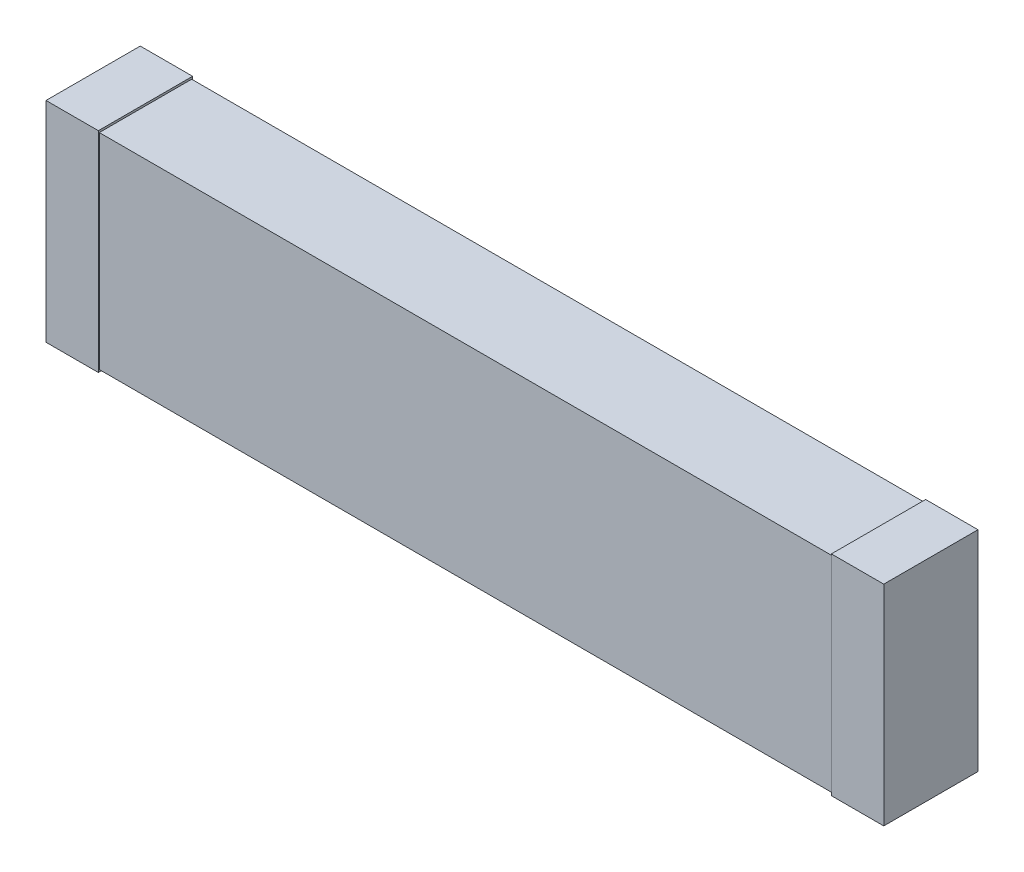
ISO-10303-21;
HEADER;
FILE_DESCRIPTION(('STEP AP214'),'2;1');
FILE_NAME('part.step','',(''),(''),'','','');
FILE_SCHEMA(('AUTOMOTIVE_DESIGN { 1 0 10303 214 1 1 1 1 }'));
ENDSEC;
DATA;
#1=APPLICATION_CONTEXT('core data for automotive mechanical design processes');
#2=APPLICATION_PROTOCOL_DEFINITION('international standard','automotive_design',2000,#1);
#3=PRODUCT_CONTEXT('',#1,'mechanical');
#4=PRODUCT('Part','Part','',(#3));
#5=PRODUCT_RELATED_PRODUCT_CATEGORY('part','',(#4));
#6=PRODUCT_DEFINITION_FORMATION('','',#4);
#7=PRODUCT_DEFINITION_CONTEXT('part definition',#1,'design');
#8=PRODUCT_DEFINITION('design','',#6,#7);
#9=PRODUCT_DEFINITION_SHAPE('','',#8);
#10=(LENGTH_UNIT() NAMED_UNIT(*) SI_UNIT(.MILLI.,.METRE.));
#11=(NAMED_UNIT(*) PLANE_ANGLE_UNIT() SI_UNIT($,.RADIAN.));
#12=(NAMED_UNIT(*) SI_UNIT($,.STERADIAN.) SOLID_ANGLE_UNIT());
#13=UNCERTAINTY_MEASURE_WITH_UNIT(LENGTH_MEASURE(1.E-05),#10,'distance_accuracy_value','');
#14=(GEOMETRIC_REPRESENTATION_CONTEXT(3) GLOBAL_UNCERTAINTY_ASSIGNED_CONTEXT((#13)) GLOBAL_UNIT_ASSIGNED_CONTEXT((#10,
#11,#12)) REPRESENTATION_CONTEXT('',''));
#15=CARTESIAN_POINT('',(0.,0.,0.));
#16=DIRECTION('',(0.,0.,1.));
#17=DIRECTION('',(1.,0.,0.));
#18=AXIS2_PLACEMENT_3D('',#15,#16,#17);
#19=CARTESIAN_POINT('',(-3.5,-0.98,0.891));
#20=DIRECTION('',(0.,0.,1.));
#21=DIRECTION('',(1.,0.,0.));
#22=AXIS2_PLACEMENT_3D('',#19,#20,#21);
#23=PLANE('',#22);
#24=DIRECTION('',(0.,1.,0.));
#25=VECTOR('',#24,1.);
#26=CARTESIAN_POINT('',(3.5,-0.98,0.891));
#27=LINE('',#26,#25);
#28=CARTESIAN_POINT('',(3.5,0.98,0.891));
#29=VERTEX_POINT('',#28);
#30=CARTESIAN_POINT('',(3.5,-0.98,0.891));
#31=VERTEX_POINT('',#30);
#32=EDGE_CURVE('P0_E76',#29,#31,#27,.F.);
#33=ORIENTED_EDGE('',*,*,#32,.F.);
#34=DIRECTION('',(1.,0.,0.));
#35=VECTOR('',#34,1.);
#36=CARTESIAN_POINT('',(-3.5,0.98,0.891));
#37=LINE('',#36,#35);
#38=CARTESIAN_POINT('',(-3.5,0.98,0.891));
#39=VERTEX_POINT('',#38);
#40=EDGE_CURVE('P0_E58',#39,#29,#37,.T.);
#41=ORIENTED_EDGE('',*,*,#40,.F.);
#42=DIRECTION('',(0.,1.,0.));
#43=VECTOR('',#42,1.);
#44=CARTESIAN_POINT('',(-3.5,-0.98,0.891));
#45=LINE('',#44,#43);
#46=CARTESIAN_POINT('',(-3.5,-0.98,0.891));
#47=VERTEX_POINT('',#46);
#48=EDGE_CURVE('P0_E20',#39,#47,#45,.F.);
#49=ORIENTED_EDGE('',*,*,#48,.T.);
#50=DIRECTION('',(1.,0.,0.));
#51=VECTOR('',#50,1.);
#52=CARTESIAN_POINT('',(-3.5,-0.98,0.891));
#53=LINE('',#52,#51);
#54=EDGE_CURVE('P0_E55',#47,#31,#53,.T.);
#55=ORIENTED_EDGE('',*,*,#54,.T.);
#56=EDGE_LOOP('',(#33,#41,#49,#55));
#57=FACE_BOUND('',#56,.T.);
#58=ADVANCED_FACE('P0_F17',(#57),#23,.T.);
#59=CARTESIAN_POINT('',(-3.5,-0.98,0.009));
#60=DIRECTION('',(1.,0.,0.));
#61=DIRECTION('',(0.,0.,-1.));
#62=AXIS2_PLACEMENT_3D('',#59,#60,#61);
#63=PLANE('',#62);
#64=DIRECTION('',(0.,0.,1.));
#65=VECTOR('',#64,1.);
#66=CARTESIAN_POINT('',(-3.5,0.98,0.009));
#67=LINE('',#66,#65);
#68=CARTESIAN_POINT('',(-3.5,0.98,0.009));
#69=VERTEX_POINT('',#68);
#70=EDGE_CURVE('P0_E78',#69,#39,#67,.T.);
#71=ORIENTED_EDGE('',*,*,#70,.F.);
#72=DIRECTION('',(0.,1.,0.));
#73=VECTOR('',#72,1.);
#74=CARTESIAN_POINT('',(-3.5,-0.98,0.009));
#75=LINE('',#74,#73);
#76=CARTESIAN_POINT('',(-3.5,-0.98,0.009));
#77=VERTEX_POINT('',#76);
#78=EDGE_CURVE('P0_E73',#69,#77,#75,.F.);
#79=ORIENTED_EDGE('',*,*,#78,.T.);
#80=DIRECTION('',(0.,0.,1.));
#81=VECTOR('',#80,1.);
#82=CARTESIAN_POINT('',(-3.5,-0.98,0.009));
#83=LINE('',#82,#81);
#84=EDGE_CURVE('P0_E63',#77,#47,#83,.T.);
#85=ORIENTED_EDGE('',*,*,#84,.T.);
#86=ORIENTED_EDGE('',*,*,#48,.F.);
#87=EDGE_LOOP('',(#71,#79,#85,#86));
#88=FACE_BOUND('',#87,.T.);
#89=ADVANCED_FACE('P0_F72',(#88),#63,.F.);
#90=CARTESIAN_POINT('',(-3.5,-0.98,0.009));
#91=DIRECTION('',(0.,1.,0.));
#92=DIRECTION('',(0.,0.,1.));
#93=AXIS2_PLACEMENT_3D('',#90,#91,#92);
#94=PLANE('',#93);
#95=ORIENTED_EDGE('',*,*,#54,.F.);
#96=ORIENTED_EDGE('',*,*,#84,.F.);
#97=DIRECTION('',(1.,0.,0.));
#98=VECTOR('',#97,1.);
#99=CARTESIAN_POINT('',(-3.5,-0.98,0.009));
#100=LINE('',#99,#98);
#101=CARTESIAN_POINT('',(3.5,-0.98,0.009));
#102=VERTEX_POINT('',#101);
#103=EDGE_CURVE('P0_E83',#77,#102,#100,.T.);
#104=ORIENTED_EDGE('',*,*,#103,.T.);
#105=DIRECTION('',(0.,0.,-1.));
#106=VECTOR('',#105,1.);
#107=CARTESIAN_POINT('',(3.5,-0.98,0.009));
#108=LINE('',#107,#106);
#109=EDGE_CURVE('P0_E69',#31,#102,#108,.T.);
#110=ORIENTED_EDGE('',*,*,#109,.F.);
#111=EDGE_LOOP('',(#95,#96,#104,#110));
#112=FACE_BOUND('',#111,.T.);
#113=ADVANCED_FACE('P0_F66',(#112),#94,.F.);
#114=CARTESIAN_POINT('',(3.5,-0.98,0.009));
#115=DIRECTION('',(1.,0.,0.));
#116=DIRECTION('',(0.,0.,-1.));
#117=AXIS2_PLACEMENT_3D('',#114,#115,#116);
#118=PLANE('',#117);
#119=DIRECTION('',(0.,0.,1.));
#120=VECTOR('',#119,1.);
#121=CARTESIAN_POINT('',(3.5,0.98,0.009));
#122=LINE('',#121,#120);
#123=CARTESIAN_POINT('',(3.5,0.98,0.009));
#124=VERTEX_POINT('',#123);
#125=EDGE_CURVE('P0_E34',#29,#124,#122,.F.);
#126=ORIENTED_EDGE('',*,*,#125,.F.);
#127=ORIENTED_EDGE('',*,*,#32,.T.);
#128=ORIENTED_EDGE('',*,*,#109,.T.);
#129=DIRECTION('',(0.,1.,0.));
#130=VECTOR('',#129,1.);
#131=CARTESIAN_POINT('',(3.5,-0.98,0.009));
#132=LINE('',#131,#130);
#133=EDGE_CURVE('P0_E26',#102,#124,#132,.T.);
#134=ORIENTED_EDGE('',*,*,#133,.T.);
#135=EDGE_LOOP('',(#126,#127,#128,#134));
#136=FACE_BOUND('',#135,.T.);
#137=ADVANCED_FACE('P0_F88',(#136),#118,.T.);
#138=CARTESIAN_POINT('',(-3.5,0.98,0.009));
#139=DIRECTION('',(0.,1.,0.));
#140=DIRECTION('',(0.,0.,1.));
#141=AXIS2_PLACEMENT_3D('',#138,#139,#140);
#142=PLANE('',#141);
#143=ORIENTED_EDGE('',*,*,#40,.T.);
#144=ORIENTED_EDGE('',*,*,#125,.T.);
#145=DIRECTION('',(1.,0.,0.));
#146=VECTOR('',#145,1.);
#147=CARTESIAN_POINT('',(-3.5,0.98,0.009));
#148=LINE('',#147,#146);
#149=EDGE_CURVE('P0_E11',#124,#69,#148,.F.);
#150=ORIENTED_EDGE('',*,*,#149,.T.);
#151=ORIENTED_EDGE('',*,*,#70,.T.);
#152=EDGE_LOOP('',(#143,#144,#150,#151));
#153=FACE_BOUND('',#152,.T.);
#154=ADVANCED_FACE('P0_F91',(#153),#142,.T.);
#155=CARTESIAN_POINT('',(-3.5,-0.98,0.009));
#156=DIRECTION('',(0.,0.,1.));
#157=DIRECTION('',(1.,0.,0.));
#158=AXIS2_PLACEMENT_3D('',#155,#156,#157);
#159=PLANE('',#158);
#160=ORIENTED_EDGE('',*,*,#133,.F.);
#161=ORIENTED_EDGE('',*,*,#103,.F.);
#162=ORIENTED_EDGE('',*,*,#78,.F.);
#163=ORIENTED_EDGE('',*,*,#149,.F.);
#164=EDGE_LOOP('',(#160,#161,#162,#163));
#165=FACE_BOUND('',#164,.T.);
#166=ADVANCED_FACE('P0_F90',(#165),#159,.F.);
#167=CLOSED_SHELL('',(#58,#89,#113,#137,#154,#166));
#168=MANIFOLD_SOLID_BREP('P0_B1',#167);
#169=CARTESIAN_POINT('',(-3.5,-1.,0.));
#170=DIRECTION('',(1.,0.,0.));
#171=DIRECTION('',(0.,0.,-1.));
#172=AXIS2_PLACEMENT_3D('',#169,#170,#171);
#173=PLANE('',#172);
#174=DIRECTION('',(0.,0.,1.));
#175=VECTOR('',#174,1.);
#176=CARTESIAN_POINT('',(-3.5,1.,0.));
#177=LINE('',#176,#175);
#178=CARTESIAN_POINT('',(-3.5,1.,0.9));
#179=VERTEX_POINT('',#178);
#180=CARTESIAN_POINT('',(-3.5,1.,0.));
#181=VERTEX_POINT('',#180);
#182=EDGE_CURVE('P1_E76',#179,#181,#177,.F.);
#183=ORIENTED_EDGE('',*,*,#182,.F.);
#184=DIRECTION('',(0.,1.,0.));
#185=VECTOR('',#184,1.);
#186=CARTESIAN_POINT('',(-3.5,-1.,0.9));
#187=LINE('',#186,#185);
#188=CARTESIAN_POINT('',(-3.5,-1.,0.9));
#189=VERTEX_POINT('',#188);
#190=EDGE_CURVE('P1_E58',#189,#179,#187,.T.);
#191=ORIENTED_EDGE('',*,*,#190,.F.);
#192=DIRECTION('',(0.,0.,1.));
#193=VECTOR('',#192,1.);
#194=CARTESIAN_POINT('',(-3.5,-1.,0.));
#195=LINE('',#194,#193);
#196=CARTESIAN_POINT('',(-3.5,-1.,0.));
#197=VERTEX_POINT('',#196);
#198=EDGE_CURVE('P1_E20',#189,#197,#195,.F.);
#199=ORIENTED_EDGE('',*,*,#198,.T.);
#200=DIRECTION('',(0.,1.,0.));
#201=VECTOR('',#200,1.);
#202=CARTESIAN_POINT('',(-3.5,-1.,0.));
#203=LINE('',#202,#201);
#204=EDGE_CURVE('P1_E55',#197,#181,#203,.T.);
#205=ORIENTED_EDGE('',*,*,#204,.T.);
#206=EDGE_LOOP('',(#183,#191,#199,#205));
#207=FACE_BOUND('',#206,.T.);
#208=ADVANCED_FACE('P1_F17',(#207),#173,.T.);
#209=CARTESIAN_POINT('',(-4.,-1.,0.));
#210=DIRECTION('',(0.,1.,0.));
#211=DIRECTION('',(0.,0.,1.));
#212=AXIS2_PLACEMENT_3D('',#209,#210,#211);
#213=PLANE('',#212);
#214=DIRECTION('',(1.,0.,0.));
#215=VECTOR('',#214,1.);
#216=CARTESIAN_POINT('',(-4.,-1.,0.9));
#217=LINE('',#216,#215);
#218=CARTESIAN_POINT('',(-4.,-1.,0.9));
#219=VERTEX_POINT('',#218);
#220=EDGE_CURVE('P1_E78',#219,#189,#217,.T.);
#221=ORIENTED_EDGE('',*,*,#220,.F.);
#222=DIRECTION('',(0.,0.,-1.));
#223=VECTOR('',#222,1.);
#224=CARTESIAN_POINT('',(-4.,-1.,0.));
#225=LINE('',#224,#223);
#226=CARTESIAN_POINT('',(-4.,-1.,0.));
#227=VERTEX_POINT('',#226);
#228=EDGE_CURVE('P1_E73',#219,#227,#225,.T.);
#229=ORIENTED_EDGE('',*,*,#228,.T.);
#230=DIRECTION('',(1.,0.,0.));
#231=VECTOR('',#230,1.);
#232=CARTESIAN_POINT('',(-4.,-1.,0.));
#233=LINE('',#232,#231);
#234=EDGE_CURVE('P1_E63',#227,#197,#233,.T.);
#235=ORIENTED_EDGE('',*,*,#234,.T.);
#236=ORIENTED_EDGE('',*,*,#198,.F.);
#237=EDGE_LOOP('',(#221,#229,#235,#236));
#238=FACE_BOUND('',#237,.T.);
#239=ADVANCED_FACE('P1_F72',(#238),#213,.F.);
#240=CARTESIAN_POINT('',(-4.,-1.,0.));
#241=DIRECTION('',(0.,0.,1.));
#242=DIRECTION('',(1.,0.,0.));
#243=AXIS2_PLACEMENT_3D('',#240,#241,#242);
#244=PLANE('',#243);
#245=ORIENTED_EDGE('',*,*,#204,.F.);
#246=ORIENTED_EDGE('',*,*,#234,.F.);
#247=DIRECTION('',(0.,1.,0.));
#248=VECTOR('',#247,1.);
#249=CARTESIAN_POINT('',(-4.,-1.,0.));
#250=LINE('',#249,#248);
#251=CARTESIAN_POINT('',(-4.,1.,0.));
#252=VERTEX_POINT('',#251);
#253=EDGE_CURVE('P1_E83',#227,#252,#250,.T.);
#254=ORIENTED_EDGE('',*,*,#253,.T.);
#255=DIRECTION('',(1.,0.,0.));
#256=VECTOR('',#255,1.);
#257=CARTESIAN_POINT('',(-4.,1.,0.));
#258=LINE('',#257,#256);
#259=EDGE_CURVE('P1_E69',#181,#252,#258,.F.);
#260=ORIENTED_EDGE('',*,*,#259,.F.);
#261=EDGE_LOOP('',(#245,#246,#254,#260));
#262=FACE_BOUND('',#261,.T.);
#263=ADVANCED_FACE('P1_F66',(#262),#244,.F.);
#264=CARTESIAN_POINT('',(-4.,1.,0.));
#265=DIRECTION('',(0.,1.,0.));
#266=DIRECTION('',(0.,0.,1.));
#267=AXIS2_PLACEMENT_3D('',#264,#265,#266);
#268=PLANE('',#267);
#269=DIRECTION('',(1.,0.,0.));
#270=VECTOR('',#269,1.);
#271=CARTESIAN_POINT('',(-4.,1.,0.9));
#272=LINE('',#271,#270);
#273=CARTESIAN_POINT('',(-4.,1.,0.9));
#274=VERTEX_POINT('',#273);
#275=EDGE_CURVE('P1_E34',#179,#274,#272,.F.);
#276=ORIENTED_EDGE('',*,*,#275,.F.);
#277=ORIENTED_EDGE('',*,*,#182,.T.);
#278=ORIENTED_EDGE('',*,*,#259,.T.);
#279=DIRECTION('',(0.,0.,-1.));
#280=VECTOR('',#279,1.);
#281=CARTESIAN_POINT('',(-4.,1.,0.));
#282=LINE('',#281,#280);
#283=EDGE_CURVE('P1_E26',#252,#274,#282,.F.);
#284=ORIENTED_EDGE('',*,*,#283,.T.);
#285=EDGE_LOOP('',(#276,#277,#278,#284));
#286=FACE_BOUND('',#285,.T.);
#287=ADVANCED_FACE('P1_F88',(#286),#268,.T.);
#288=CARTESIAN_POINT('',(-4.,-1.,0.9));
#289=DIRECTION('',(0.,0.,1.));
#290=DIRECTION('',(1.,0.,0.));
#291=AXIS2_PLACEMENT_3D('',#288,#289,#290);
#292=PLANE('',#291);
#293=ORIENTED_EDGE('',*,*,#190,.T.);
#294=ORIENTED_EDGE('',*,*,#275,.T.);
#295=DIRECTION('',(0.,1.,0.));
#296=VECTOR('',#295,1.);
#297=CARTESIAN_POINT('',(-4.,-1.,0.9));
#298=LINE('',#297,#296);
#299=EDGE_CURVE('P1_E11',#274,#219,#298,.F.);
#300=ORIENTED_EDGE('',*,*,#299,.T.);
#301=ORIENTED_EDGE('',*,*,#220,.T.);
#302=EDGE_LOOP('',(#293,#294,#300,#301));
#303=FACE_BOUND('',#302,.T.);
#304=ADVANCED_FACE('P1_F91',(#303),#292,.T.);
#305=CARTESIAN_POINT('',(-4.,-1.,0.));
#306=DIRECTION('',(1.,0.,0.));
#307=DIRECTION('',(0.,0.,-1.));
#308=AXIS2_PLACEMENT_3D('',#305,#306,#307);
#309=PLANE('',#308);
#310=ORIENTED_EDGE('',*,*,#283,.F.);
#311=ORIENTED_EDGE('',*,*,#253,.F.);
#312=ORIENTED_EDGE('',*,*,#228,.F.);
#313=ORIENTED_EDGE('',*,*,#299,.F.);
#314=EDGE_LOOP('',(#310,#311,#312,#313));
#315=FACE_BOUND('',#314,.T.);
#316=ADVANCED_FACE('P1_F90',(#315),#309,.F.);
#317=CLOSED_SHELL('',(#208,#239,#263,#287,#304,#316));
#318=MANIFOLD_SOLID_BREP('P1_B1',#317);
#319=CARTESIAN_POINT('',(4.,-1.,0.));
#320=DIRECTION('',(1.,0.,0.));
#321=DIRECTION('',(0.,0.,-1.));
#322=AXIS2_PLACEMENT_3D('',#319,#320,#321);
#323=PLANE('',#322);
#324=DIRECTION('',(0.,0.,1.));
#325=VECTOR('',#324,1.);
#326=CARTESIAN_POINT('',(4.,1.,0.));
#327=LINE('',#326,#325);
#328=CARTESIAN_POINT('',(4.,1.,0.9));
#329=VERTEX_POINT('',#328);
#330=CARTESIAN_POINT('',(4.,1.,0.));
#331=VERTEX_POINT('',#330);
#332=EDGE_CURVE('P2_E76',#329,#331,#327,.F.);
#333=ORIENTED_EDGE('',*,*,#332,.F.);
#334=DIRECTION('',(0.,1.,0.));
#335=VECTOR('',#334,1.);
#336=CARTESIAN_POINT('',(4.,-1.,0.9));
#337=LINE('',#336,#335);
#338=CARTESIAN_POINT('',(4.,-1.,0.9));
#339=VERTEX_POINT('',#338);
#340=EDGE_CURVE('P2_E58',#339,#329,#337,.T.);
#341=ORIENTED_EDGE('',*,*,#340,.F.);
#342=DIRECTION('',(0.,0.,1.));
#343=VECTOR('',#342,1.);
#344=CARTESIAN_POINT('',(4.,-1.,0.));
#345=LINE('',#344,#343);
#346=CARTESIAN_POINT('',(4.,-1.,0.));
#347=VERTEX_POINT('',#346);
#348=EDGE_CURVE('P2_E20',#339,#347,#345,.F.);
#349=ORIENTED_EDGE('',*,*,#348,.T.);
#350=DIRECTION('',(0.,1.,0.));
#351=VECTOR('',#350,1.);
#352=CARTESIAN_POINT('',(4.,-1.,0.));
#353=LINE('',#352,#351);
#354=EDGE_CURVE('P2_E55',#347,#331,#353,.T.);
#355=ORIENTED_EDGE('',*,*,#354,.T.);
#356=EDGE_LOOP('',(#333,#341,#349,#355));
#357=FACE_BOUND('',#356,.T.);
#358=ADVANCED_FACE('P2_F17',(#357),#323,.T.);
#359=CARTESIAN_POINT('',(3.5,-1.,0.));
#360=DIRECTION('',(0.,1.,0.));
#361=DIRECTION('',(0.,0.,1.));
#362=AXIS2_PLACEMENT_3D('',#359,#360,#361);
#363=PLANE('',#362);
#364=DIRECTION('',(1.,0.,0.));
#365=VECTOR('',#364,1.);
#366=CARTESIAN_POINT('',(3.5,-1.,0.9));
#367=LINE('',#366,#365);
#368=CARTESIAN_POINT('',(3.5,-1.,0.9));
#369=VERTEX_POINT('',#368);
#370=EDGE_CURVE('P2_E78',#369,#339,#367,.T.);
#371=ORIENTED_EDGE('',*,*,#370,.F.);
#372=DIRECTION('',(0.,0.,-1.));
#373=VECTOR('',#372,1.);
#374=CARTESIAN_POINT('',(3.5,-1.,0.));
#375=LINE('',#374,#373);
#376=CARTESIAN_POINT('',(3.5,-1.,0.));
#377=VERTEX_POINT('',#376);
#378=EDGE_CURVE('P2_E73',#369,#377,#375,.T.);
#379=ORIENTED_EDGE('',*,*,#378,.T.);
#380=DIRECTION('',(1.,0.,0.));
#381=VECTOR('',#380,1.);
#382=CARTESIAN_POINT('',(3.5,-1.,0.));
#383=LINE('',#382,#381);
#384=EDGE_CURVE('P2_E63',#377,#347,#383,.T.);
#385=ORIENTED_EDGE('',*,*,#384,.T.);
#386=ORIENTED_EDGE('',*,*,#348,.F.);
#387=EDGE_LOOP('',(#371,#379,#385,#386));
#388=FACE_BOUND('',#387,.T.);
#389=ADVANCED_FACE('P2_F72',(#388),#363,.F.);
#390=CARTESIAN_POINT('',(3.5,-1.,0.));
#391=DIRECTION('',(0.,0.,1.));
#392=DIRECTION('',(1.,0.,0.));
#393=AXIS2_PLACEMENT_3D('',#390,#391,#392);
#394=PLANE('',#393);
#395=ORIENTED_EDGE('',*,*,#354,.F.);
#396=ORIENTED_EDGE('',*,*,#384,.F.);
#397=DIRECTION('',(0.,1.,0.));
#398=VECTOR('',#397,1.);
#399=CARTESIAN_POINT('',(3.5,-1.,0.));
#400=LINE('',#399,#398);
#401=CARTESIAN_POINT('',(3.5,1.,0.));
#402=VERTEX_POINT('',#401);
#403=EDGE_CURVE('P2_E83',#377,#402,#400,.T.);
#404=ORIENTED_EDGE('',*,*,#403,.T.);
#405=DIRECTION('',(1.,0.,0.));
#406=VECTOR('',#405,1.);
#407=CARTESIAN_POINT('',(3.5,1.,0.));
#408=LINE('',#407,#406);
#409=EDGE_CURVE('P2_E69',#331,#402,#408,.F.);
#410=ORIENTED_EDGE('',*,*,#409,.F.);
#411=EDGE_LOOP('',(#395,#396,#404,#410));
#412=FACE_BOUND('',#411,.T.);
#413=ADVANCED_FACE('P2_F66',(#412),#394,.F.);
#414=CARTESIAN_POINT('',(3.5,1.,0.));
#415=DIRECTION('',(0.,1.,0.));
#416=DIRECTION('',(0.,0.,1.));
#417=AXIS2_PLACEMENT_3D('',#414,#415,#416);
#418=PLANE('',#417);
#419=DIRECTION('',(1.,0.,0.));
#420=VECTOR('',#419,1.);
#421=CARTESIAN_POINT('',(3.5,1.,0.9));
#422=LINE('',#421,#420);
#423=CARTESIAN_POINT('',(3.5,1.,0.9));
#424=VERTEX_POINT('',#423);
#425=EDGE_CURVE('P2_E34',#329,#424,#422,.F.);
#426=ORIENTED_EDGE('',*,*,#425,.F.);
#427=ORIENTED_EDGE('',*,*,#332,.T.);
#428=ORIENTED_EDGE('',*,*,#409,.T.);
#429=DIRECTION('',(0.,0.,-1.));
#430=VECTOR('',#429,1.);
#431=CARTESIAN_POINT('',(3.5,1.,0.));
#432=LINE('',#431,#430);
#433=EDGE_CURVE('P2_E26',#402,#424,#432,.F.);
#434=ORIENTED_EDGE('',*,*,#433,.T.);
#435=EDGE_LOOP('',(#426,#427,#428,#434));
#436=FACE_BOUND('',#435,.T.);
#437=ADVANCED_FACE('P2_F88',(#436),#418,.T.);
#438=CARTESIAN_POINT('',(3.5,-1.,0.9));
#439=DIRECTION('',(0.,0.,1.));
#440=DIRECTION('',(1.,0.,0.));
#441=AXIS2_PLACEMENT_3D('',#438,#439,#440);
#442=PLANE('',#441);
#443=ORIENTED_EDGE('',*,*,#340,.T.);
#444=ORIENTED_EDGE('',*,*,#425,.T.);
#445=DIRECTION('',(0.,1.,0.));
#446=VECTOR('',#445,1.);
#447=CARTESIAN_POINT('',(3.5,-1.,0.9));
#448=LINE('',#447,#446);
#449=EDGE_CURVE('P2_E11',#424,#369,#448,.F.);
#450=ORIENTED_EDGE('',*,*,#449,.T.);
#451=ORIENTED_EDGE('',*,*,#370,.T.);
#452=EDGE_LOOP('',(#443,#444,#450,#451));
#453=FACE_BOUND('',#452,.T.);
#454=ADVANCED_FACE('P2_F91',(#453),#442,.T.);
#455=CARTESIAN_POINT('',(3.5,-1.,0.));
#456=DIRECTION('',(1.,0.,0.));
#457=DIRECTION('',(0.,0.,-1.));
#458=AXIS2_PLACEMENT_3D('',#455,#456,#457);
#459=PLANE('',#458);
#460=ORIENTED_EDGE('',*,*,#433,.F.);
#461=ORIENTED_EDGE('',*,*,#403,.F.);
#462=ORIENTED_EDGE('',*,*,#378,.F.);
#463=ORIENTED_EDGE('',*,*,#449,.F.);
#464=EDGE_LOOP('',(#460,#461,#462,#463));
#465=FACE_BOUND('',#464,.T.);
#466=ADVANCED_FACE('P2_F90',(#465),#459,.F.);
#467=CLOSED_SHELL('',(#358,#389,#413,#437,#454,#466));
#468=MANIFOLD_SOLID_BREP('P2_B1',#467);
#469=ADVANCED_BREP_SHAPE_REPRESENTATION('',(#18,#168,#318,#468),#14);
#470=SHAPE_DEFINITION_REPRESENTATION(#9,#469);
ENDSEC;
END-ISO-10303-21;
